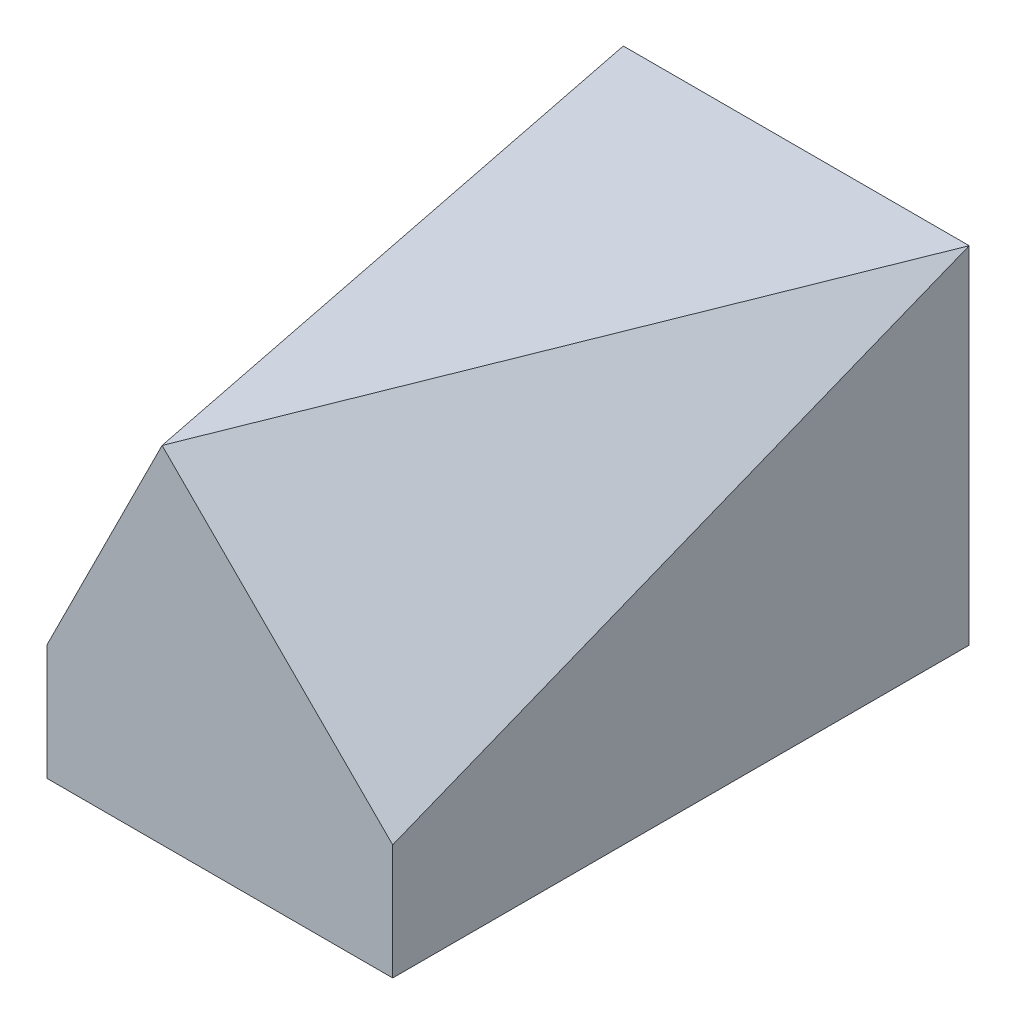
ISO-10303-21;
HEADER;
FILE_DESCRIPTION(('STEP AP214'),'2;1');
FILE_NAME('part.step','',(''),(''),'','','');
FILE_SCHEMA(('AUTOMOTIVE_DESIGN { 1 0 10303 214 1 1 1 1 }'));
ENDSEC;
DATA;
#1=APPLICATION_CONTEXT('core data for automotive mechanical design processes');
#2=APPLICATION_PROTOCOL_DEFINITION('international standard','automotive_design',2000,#1);
#3=PRODUCT_CONTEXT('',#1,'mechanical');
#4=PRODUCT('Part','Part','',(#3));
#5=PRODUCT_RELATED_PRODUCT_CATEGORY('part','',(#4));
#6=PRODUCT_DEFINITION_FORMATION('','',#4);
#7=PRODUCT_DEFINITION_CONTEXT('part definition',#1,'design');
#8=PRODUCT_DEFINITION('design','',#6,#7);
#9=PRODUCT_DEFINITION_SHAPE('','',#8);
#10=(LENGTH_UNIT() NAMED_UNIT(*) SI_UNIT(.MILLI.,.METRE.));
#11=(NAMED_UNIT(*) PLANE_ANGLE_UNIT() SI_UNIT($,.RADIAN.));
#12=(NAMED_UNIT(*) SI_UNIT($,.STERADIAN.) SOLID_ANGLE_UNIT());
#13=UNCERTAINTY_MEASURE_WITH_UNIT(LENGTH_MEASURE(1.E-05),#10,'distance_accuracy_value','');
#14=(GEOMETRIC_REPRESENTATION_CONTEXT(3) GLOBAL_UNCERTAINTY_ASSIGNED_CONTEXT((#13)) GLOBAL_UNIT_ASSIGNED_CONTEXT((#10,
#11,#12)) REPRESENTATION_CONTEXT('',''));
#15=CARTESIAN_POINT('',(0.,0.,0.));
#16=DIRECTION('',(0.,0.,1.));
#17=DIRECTION('',(1.,0.,0.));
#18=AXIS2_PLACEMENT_3D('',#15,#16,#17);
#19=CARTESIAN_POINT('',(-1.625,8.5,1.875));
#20=DIRECTION('',(0.,0.,-1.));
#21=DIRECTION('',(-1.,0.,0.));
#22=AXIS2_PLACEMENT_3D('',#19,#20,#21);
#23=PLANE('',#22);
#24=DIRECTION('',(0.707106781186547,-0.707106781186548,0.));
#25=VECTOR('',#24,1.);
#26=CARTESIAN_POINT('',(-1.125,9.,1.875));
#27=LINE('',#26,#25);
#28=CARTESIAN_POINT('',(-0.625000000000003,8.5,1.875));
#29=VERTEX_POINT('',#28);
#30=CARTESIAN_POINT('',(1.375,6.5,1.875));
#31=VERTEX_POINT('',#30);
#32=EDGE_CURVE('E50',#29,#31,#27,.T.);
#33=ORIENTED_EDGE('',*,*,#32,.F.);
#34=DIRECTION('',(0.447213595499958,0.894427190999916,0.));
#35=VECTOR('',#34,1.);
#36=CARTESIAN_POINT('',(-0.825000000000002,8.1,1.875));
#37=LINE('',#36,#35);
#38=CARTESIAN_POINT('',(-1.625,6.5,1.875));
#39=VERTEX_POINT('',#38);
#40=EDGE_CURVE('E114',#39,#29,#37,.T.);
#41=ORIENTED_EDGE('',*,*,#40,.F.);
#42=DIRECTION('',(0.,-1.,0.));
#43=VECTOR('',#42,1.);
#44=CARTESIAN_POINT('',(-1.625,8.5,1.875));
#45=LINE('',#44,#43);
#46=CARTESIAN_POINT('',(-1.625,5.5,1.875));
#47=VERTEX_POINT('',#46);
#48=EDGE_CURVE('E100',#39,#47,#45,.T.);
#49=ORIENTED_EDGE('',*,*,#48,.T.);
#50=DIRECTION('',(1.,0.,0.));
#51=VECTOR('',#50,1.);
#52=CARTESIAN_POINT('',(-1.625,5.5,1.875));
#53=LINE('',#52,#51);
#54=CARTESIAN_POINT('',(1.375,5.5,1.875));
#55=VERTEX_POINT('',#54);
#56=EDGE_CURVE('E95',#47,#55,#53,.T.);
#57=ORIENTED_EDGE('',*,*,#56,.T.);
#58=DIRECTION('',(0.,-1.,0.));
#59=VECTOR('',#58,1.);
#60=CARTESIAN_POINT('',(1.375,8.5,1.875));
#61=LINE('',#60,#59);
#62=EDGE_CURVE('E57',#31,#55,#61,.T.);
#63=ORIENTED_EDGE('',*,*,#62,.F.);
#64=EDGE_LOOP('',(#33,#41,#49,#57,#63));
#65=FACE_BOUND('',#64,.T.);
#66=ADVANCED_FACE('F36',(#65),#23,.F.);
#67=CARTESIAN_POINT('',(-0.125000000000002,8.5,-0.625));
#68=DIRECTION('',(0.,-1.,0.));
#69=DIRECTION('',(0.,0.,-1.));
#70=AXIS2_PLACEMENT_3D('',#67,#68,#69);
#71=PLANE('',#70);
#72=DIRECTION('',(-0.371390676354104,0.,0.928476690885259));
#73=VECTOR('',#72,1.);
#74=CARTESIAN_POINT('',(0.306034482758617,8.5,-0.452586206896553));
#75=LINE('',#74,#73);
#76=CARTESIAN_POINT('',(1.375,8.5,-3.125));
#77=VERTEX_POINT('',#76);
#78=EDGE_CURVE('E79',#77,#29,#75,.T.);
#79=ORIENTED_EDGE('',*,*,#78,.F.);
#80=DIRECTION('',(-1.,0.,0.));
#81=VECTOR('',#80,1.);
#82=CARTESIAN_POINT('',(-1.625,8.5,-3.125));
#83=LINE('',#82,#81);
#84=CARTESIAN_POINT('',(-1.625,8.5,-3.125));
#85=VERTEX_POINT('',#84);
#86=EDGE_CURVE('E86',#77,#85,#83,.T.);
#87=ORIENTED_EDGE('',*,*,#86,.T.);
#88=DIRECTION('',(-0.196116135138184,0.,-0.98058067569092));
#89=VECTOR('',#88,1.);
#90=CARTESIAN_POINT('',(-1.08653846153846,8.5,-0.432692307692308));
#91=LINE('',#90,#89);
#92=EDGE_CURVE('E44',#29,#85,#91,.T.);
#93=ORIENTED_EDGE('',*,*,#92,.F.);
#94=EDGE_LOOP('',(#79,#87,#93));
#95=FACE_BOUND('',#94,.T.);
#96=ADVANCED_FACE('F85',(#95),#71,.F.);
#97=CARTESIAN_POINT('',(1.375,8.5,1.875));
#98=DIRECTION('',(-1.,0.,0.));
#99=DIRECTION('',(0.,0.,1.));
#100=AXIS2_PLACEMENT_3D('',#97,#98,#99);
#101=PLANE('',#100);
#102=DIRECTION('',(0.,0.371390676354104,-0.928476690885259));
#103=VECTOR('',#102,1.);
#104=CARTESIAN_POINT('',(1.375,6.77586206896551,1.18534482758621));
#105=LINE('',#104,#103);
#106=EDGE_CURVE('E11',#31,#77,#105,.T.);
#107=ORIENTED_EDGE('',*,*,#106,.F.);
#108=ORIENTED_EDGE('',*,*,#62,.T.);
#109=DIRECTION('',(0.,0.,-1.));
#110=VECTOR('',#109,1.);
#111=CARTESIAN_POINT('',(1.375,5.5,1.875));
#112=LINE('',#111,#110);
#113=CARTESIAN_POINT('',(1.375,5.5,-3.125));
#114=VERTEX_POINT('',#113);
#115=EDGE_CURVE('E98',#55,#114,#112,.T.);
#116=ORIENTED_EDGE('',*,*,#115,.T.);
#117=DIRECTION('',(0.,-1.,0.));
#118=VECTOR('',#117,1.);
#119=CARTESIAN_POINT('',(1.375,8.5,-3.125));
#120=LINE('',#119,#118);
#121=EDGE_CURVE('E92',#77,#114,#120,.T.);
#122=ORIENTED_EDGE('',*,*,#121,.F.);
#123=EDGE_LOOP('',(#107,#108,#116,#122));
#124=FACE_BOUND('',#123,.T.);
#125=ADVANCED_FACE('F38',(#124),#101,.F.);
#126=CARTESIAN_POINT('',(-1.625,8.5,1.875));
#127=DIRECTION('',(1.,0.,0.));
#128=DIRECTION('',(0.,0.,-1.));
#129=AXIS2_PLACEMENT_3D('',#126,#127,#128);
#130=PLANE('',#129);
#131=DIRECTION('',(0.,-0.371390676354104,0.928476690885259));
#132=VECTOR('',#131,1.);
#133=CARTESIAN_POINT('',(-1.625,6.77586206896552,1.18534482758621));
#134=LINE('',#133,#132);
#135=EDGE_CURVE('E111',#85,#39,#134,.T.);
#136=ORIENTED_EDGE('',*,*,#135,.F.);
#137=DIRECTION('',(0.,-1.,0.));
#138=VECTOR('',#137,1.);
#139=CARTESIAN_POINT('',(-1.625,8.5,-3.125));
#140=LINE('',#139,#138);
#141=CARTESIAN_POINT('',(-1.625,5.5,-3.125));
#142=VERTEX_POINT('',#141);
#143=EDGE_CURVE('E94',#85,#142,#140,.T.);
#144=ORIENTED_EDGE('',*,*,#143,.T.);
#145=DIRECTION('',(0.,0.,1.));
#146=VECTOR('',#145,1.);
#147=CARTESIAN_POINT('',(-1.625,5.5,1.875));
#148=LINE('',#147,#146);
#149=EDGE_CURVE('E106',#142,#47,#148,.T.);
#150=ORIENTED_EDGE('',*,*,#149,.T.);
#151=ORIENTED_EDGE('',*,*,#48,.F.);
#152=EDGE_LOOP('',(#136,#144,#150,#151));
#153=FACE_BOUND('',#152,.T.);
#154=ADVANCED_FACE('F124',(#153),#130,.F.);
#155=CARTESIAN_POINT('',(-1.625,8.5,-3.125));
#156=DIRECTION('',(0.,0.,1.));
#157=DIRECTION('',(1.,0.,0.));
#158=AXIS2_PLACEMENT_3D('',#155,#156,#157);
#159=PLANE('',#158);
#160=DIRECTION('',(-1.,0.,0.));
#161=VECTOR('',#160,1.);
#162=CARTESIAN_POINT('',(-1.625,5.5,-3.125));
#163=LINE('',#162,#161);
#164=EDGE_CURVE('E109',#114,#142,#163,.T.);
#165=ORIENTED_EDGE('',*,*,#164,.T.);
#166=ORIENTED_EDGE('',*,*,#143,.F.);
#167=ORIENTED_EDGE('',*,*,#86,.F.);
#168=ORIENTED_EDGE('',*,*,#121,.T.);
#169=EDGE_LOOP('',(#165,#166,#167,#168));
#170=FACE_BOUND('',#169,.T.);
#171=ADVANCED_FACE('F91',(#170),#159,.F.);
#172=CARTESIAN_POINT('',(-0.125000000000002,5.5,-0.625));
#173=DIRECTION('',(0.,-1.,0.));
#174=DIRECTION('',(0.,0.,-1.));
#175=AXIS2_PLACEMENT_3D('',#172,#173,#174);
#176=PLANE('',#175);
#177=ORIENTED_EDGE('',*,*,#115,.F.);
#178=ORIENTED_EDGE('',*,*,#56,.F.);
#179=ORIENTED_EDGE('',*,*,#149,.F.);
#180=ORIENTED_EDGE('',*,*,#164,.F.);
#181=EDGE_LOOP('',(#177,#178,#179,#180));
#182=FACE_BOUND('',#181,.T.);
#183=ADVANCED_FACE('F128',(#182),#176,.T.);
#184=CARTESIAN_POINT('',(-2.06298449612403,6.46899224806202,-0.237403100775194));
#185=DIRECTION('',(-0.880450906325624,0.440225453162812,0.176090181265125));
#186=DIRECTION('',(-0.447213595499958,-0.894427190999916,0.));
#187=AXIS2_PLACEMENT_3D('',#184,#185,#186);
#188=PLANE('',#187);
#189=ORIENTED_EDGE('',*,*,#135,.T.);
#190=ORIENTED_EDGE('',*,*,#40,.T.);
#191=ORIENTED_EDGE('',*,*,#92,.T.);
#192=EDGE_LOOP('',(#189,#190,#191));
#193=FACE_BOUND('',#192,.T.);
#194=ADVANCED_FACE('F119',(#193),#188,.T.);
#195=CARTESIAN_POINT('',(1.49537037037037,7.12037037037037,0.0231481481481474));
#196=DIRECTION('',(0.680413817439772,0.680413817439772,0.272165526975909));
#197=DIRECTION('',(-0.707106781186547,0.707106781186548,0.));
#198=AXIS2_PLACEMENT_3D('',#195,#196,#197);
#199=PLANE('',#198);
#200=ORIENTED_EDGE('',*,*,#32,.T.);
#201=ORIENTED_EDGE('',*,*,#106,.T.);
#202=ORIENTED_EDGE('',*,*,#78,.T.);
#203=EDGE_LOOP('',(#200,#201,#202));
#204=FACE_BOUND('',#203,.T.);
#205=ADVANCED_FACE('F78',(#204),#199,.T.);
#206=CLOSED_SHELL('',(#66,#96,#125,#154,#171,#183,#194,#205));
#207=MANIFOLD_SOLID_BREP('B2',#206);
#208=ADVANCED_BREP_SHAPE_REPRESENTATION('',(#18,#207),#14);
#209=SHAPE_DEFINITION_REPRESENTATION(#9,#208);
ENDSEC;
END-ISO-10303-21;
